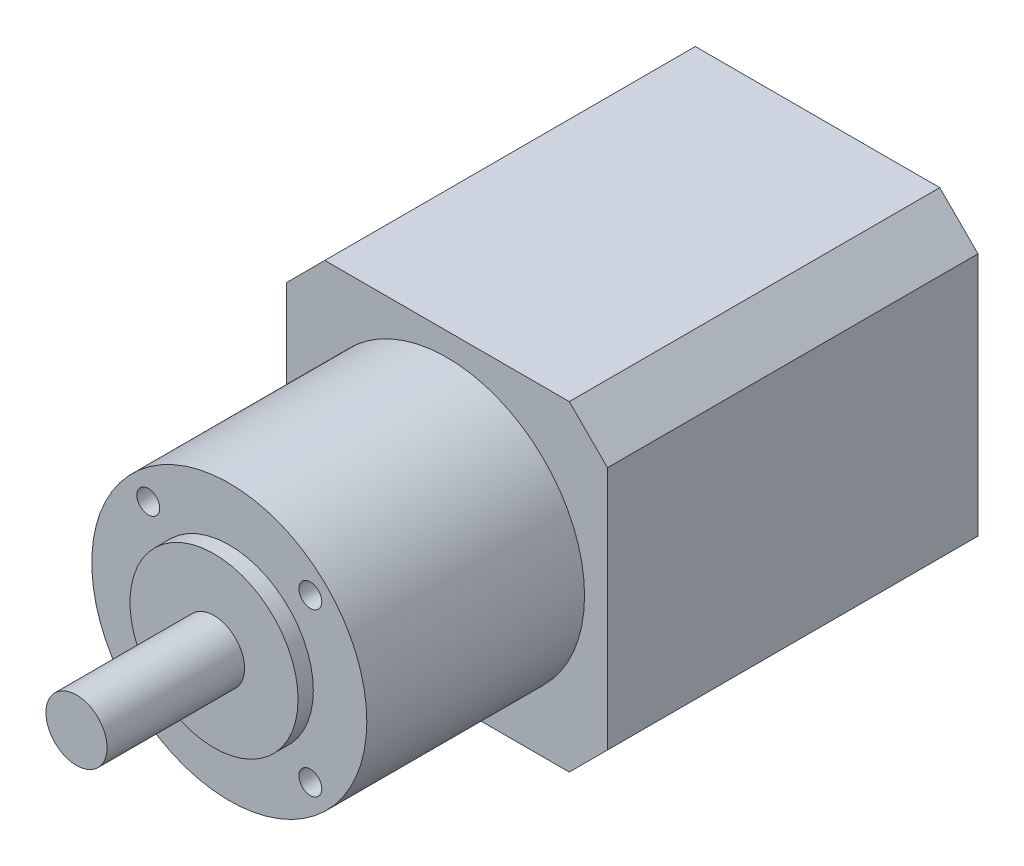
ISO-10303-21;
HEADER;
FILE_DESCRIPTION(('STEP AP214'),'2;1');
FILE_NAME('part.step','',(''),(''),'','','');
FILE_SCHEMA(('AUTOMOTIVE_DESIGN { 1 0 10303 214 1 1 1 1 }'));
ENDSEC;
DATA;
#1=APPLICATION_CONTEXT('core data for automotive mechanical design processes');
#2=APPLICATION_PROTOCOL_DEFINITION('international standard','automotive_design',2000,#1);
#3=PRODUCT_CONTEXT('',#1,'mechanical');
#4=PRODUCT('Part','Part','',(#3));
#5=PRODUCT_RELATED_PRODUCT_CATEGORY('part','',(#4));
#6=PRODUCT_DEFINITION_FORMATION('','',#4);
#7=PRODUCT_DEFINITION_CONTEXT('part definition',#1,'design');
#8=PRODUCT_DEFINITION('design','',#6,#7);
#9=PRODUCT_DEFINITION_SHAPE('','',#8);
#10=(LENGTH_UNIT() NAMED_UNIT(*) SI_UNIT(.MILLI.,.METRE.));
#11=(NAMED_UNIT(*) PLANE_ANGLE_UNIT() SI_UNIT($,.RADIAN.));
#12=(NAMED_UNIT(*) SI_UNIT($,.STERADIAN.) SOLID_ANGLE_UNIT());
#13=UNCERTAINTY_MEASURE_WITH_UNIT(LENGTH_MEASURE(1.E-05),#10,'distance_accuracy_value','');
#14=(GEOMETRIC_REPRESENTATION_CONTEXT(3) GLOBAL_UNCERTAINTY_ASSIGNED_CONTEXT((#13)) GLOBAL_UNIT_ASSIGNED_CONTEXT((#10,
#11,#12)) REPRESENTATION_CONTEXT('',''));
#15=CARTESIAN_POINT('',(0.,0.,0.));
#16=DIRECTION('',(0.,0.,1.));
#17=DIRECTION('',(1.,0.,0.));
#18=AXIS2_PLACEMENT_3D('',#15,#16,#17);
#19=CARTESIAN_POINT('',(21.,21.,48.5));
#20=DIRECTION('',(-1.,0.,0.));
#21=DIRECTION('',(0.,-1.,0.));
#22=AXIS2_PLACEMENT_3D('',#19,#20,#21);
#23=PLANE('',#22);
#24=DIRECTION('',(0.,1.,0.));
#25=VECTOR('',#24,1.);
#26=CARTESIAN_POINT('',(21.,21.,48.5));
#27=LINE('',#26,#25);
#28=CARTESIAN_POINT('',(21.,-16.,48.5));
#29=VERTEX_POINT('',#28);
#30=CARTESIAN_POINT('',(21.,16.,48.5));
#31=VERTEX_POINT('',#30);
#32=EDGE_CURVE('E126',#29,#31,#27,.T.);
#33=ORIENTED_EDGE('',*,*,#32,.F.);
#34=DIRECTION('',(0.,0.,-1.));
#35=VECTOR('',#34,1.);
#36=CARTESIAN_POINT('',(21.,-16.,48.5));
#37=LINE('',#36,#35);
#38=CARTESIAN_POINT('',(21.,-16.,0.));
#39=VERTEX_POINT('',#38);
#40=EDGE_CURVE('E110',#29,#39,#37,.T.);
#41=ORIENTED_EDGE('',*,*,#40,.T.);
#42=DIRECTION('',(0.,1.,0.));
#43=VECTOR('',#42,1.);
#44=CARTESIAN_POINT('',(21.,21.,0.));
#45=LINE('',#44,#43);
#46=CARTESIAN_POINT('',(21.,16.,0.));
#47=VERTEX_POINT('',#46);
#48=EDGE_CURVE('E123',#39,#47,#45,.T.);
#49=ORIENTED_EDGE('',*,*,#48,.T.);
#50=DIRECTION('',(0.,0.,1.));
#51=VECTOR('',#50,1.);
#52=CARTESIAN_POINT('',(21.,16.,48.5));
#53=LINE('',#52,#51);
#54=EDGE_CURVE('E129',#47,#31,#53,.T.);
#55=ORIENTED_EDGE('',*,*,#54,.T.);
#56=EDGE_LOOP('',(#33,#41,#49,#55));
#57=FACE_BOUND('',#56,.T.);
#58=ADVANCED_FACE('F39',(#57),#23,.F.);
#59=CARTESIAN_POINT('',(-21.,21.,48.5));
#60=DIRECTION('',(0.,-1.,0.));
#61=DIRECTION('',(0.,0.,-1.));
#62=AXIS2_PLACEMENT_3D('',#59,#60,#61);
#63=PLANE('',#62);
#64=DIRECTION('',(-1.,0.,0.));
#65=VECTOR('',#64,1.);
#66=CARTESIAN_POINT('',(-21.,21.,48.5));
#67=LINE('',#66,#65);
#68=CARTESIAN_POINT('',(16.,21.,48.5));
#69=VERTEX_POINT('',#68);
#70=CARTESIAN_POINT('',(-16.,21.,48.5));
#71=VERTEX_POINT('',#70);
#72=EDGE_CURVE('E195',#69,#71,#67,.T.);
#73=ORIENTED_EDGE('',*,*,#72,.F.);
#74=DIRECTION('',(0.,0.,-1.));
#75=VECTOR('',#74,1.);
#76=CARTESIAN_POINT('',(16.,21.,48.5));
#77=LINE('',#76,#75);
#78=CARTESIAN_POINT('',(16.,21.,0.));
#79=VERTEX_POINT('',#78);
#80=EDGE_CURVE('E183',#69,#79,#77,.T.);
#81=ORIENTED_EDGE('',*,*,#80,.T.);
#82=DIRECTION('',(-1.,0.,0.));
#83=VECTOR('',#82,1.);
#84=CARTESIAN_POINT('',(-21.,21.,0.));
#85=LINE('',#84,#83);
#86=CARTESIAN_POINT('',(-16.,21.,0.));
#87=VERTEX_POINT('',#86);
#88=EDGE_CURVE('E134',#79,#87,#85,.T.);
#89=ORIENTED_EDGE('',*,*,#88,.T.);
#90=DIRECTION('',(0.,0.,1.));
#91=VECTOR('',#90,1.);
#92=CARTESIAN_POINT('',(-16.,21.,48.5));
#93=LINE('',#92,#91);
#94=EDGE_CURVE('E180',#87,#71,#93,.T.);
#95=ORIENTED_EDGE('',*,*,#94,.T.);
#96=EDGE_LOOP('',(#73,#81,#89,#95));
#97=FACE_BOUND('',#96,.T.);
#98=ADVANCED_FACE('F286',(#97),#63,.F.);
#99=CARTESIAN_POINT('',(-21.,21.,48.5));
#100=DIRECTION('',(1.,0.,0.));
#101=DIRECTION('',(0.,1.,0.));
#102=AXIS2_PLACEMENT_3D('',#99,#100,#101);
#103=PLANE('',#102);
#104=DIRECTION('',(0.,-1.,0.));
#105=VECTOR('',#104,1.);
#106=CARTESIAN_POINT('',(-21.,21.,48.5));
#107=LINE('',#106,#105);
#108=CARTESIAN_POINT('',(-21.,16.,48.5));
#109=VERTEX_POINT('',#108);
#110=CARTESIAN_POINT('',(-21.,-16.,48.5));
#111=VERTEX_POINT('',#110);
#112=EDGE_CURVE('E193',#109,#111,#107,.T.);
#113=ORIENTED_EDGE('',*,*,#112,.F.);
#114=DIRECTION('',(0.,0.,-1.));
#115=VECTOR('',#114,1.);
#116=CARTESIAN_POINT('',(-21.,16.,48.5));
#117=LINE('',#116,#115);
#118=CARTESIAN_POINT('',(-21.,16.,0.));
#119=VERTEX_POINT('',#118);
#120=EDGE_CURVE('E11',#109,#119,#117,.T.);
#121=ORIENTED_EDGE('',*,*,#120,.T.);
#122=DIRECTION('',(0.,-1.,0.));
#123=VECTOR('',#122,1.);
#124=CARTESIAN_POINT('',(-21.,21.,0.));
#125=LINE('',#124,#123);
#126=CARTESIAN_POINT('',(-21.,-16.,0.));
#127=VERTEX_POINT('',#126);
#128=EDGE_CURVE('E140',#119,#127,#125,.T.);
#129=ORIENTED_EDGE('',*,*,#128,.T.);
#130=DIRECTION('',(0.,0.,1.));
#131=VECTOR('',#130,1.);
#132=CARTESIAN_POINT('',(-21.,-16.,48.5));
#133=LINE('',#132,#131);
#134=EDGE_CURVE('E48',#127,#111,#133,.T.);
#135=ORIENTED_EDGE('',*,*,#134,.T.);
#136=EDGE_LOOP('',(#113,#121,#129,#135));
#137=FACE_BOUND('',#136,.T.);
#138=ADVANCED_FACE('F279',(#137),#103,.F.);
#139=CARTESIAN_POINT('',(-21.,-21.,48.5));
#140=DIRECTION('',(0.,1.,0.));
#141=DIRECTION('',(0.,0.,1.));
#142=AXIS2_PLACEMENT_3D('',#139,#140,#141);
#143=PLANE('',#142);
#144=DIRECTION('',(1.,0.,0.));
#145=VECTOR('',#144,1.);
#146=CARTESIAN_POINT('',(-21.,-21.,0.));
#147=LINE('',#146,#145);
#148=CARTESIAN_POINT('',(-16.,-21.,0.));
#149=VERTEX_POINT('',#148);
#150=CARTESIAN_POINT('',(16.,-21.,0.));
#151=VERTEX_POINT('',#150);
#152=EDGE_CURVE('E151',#149,#151,#147,.T.);
#153=ORIENTED_EDGE('',*,*,#152,.T.);
#154=DIRECTION('',(0.,0.,1.));
#155=VECTOR('',#154,1.);
#156=CARTESIAN_POINT('',(16.,-21.,48.5));
#157=LINE('',#156,#155);
#158=CARTESIAN_POINT('',(16.,-21.,48.5));
#159=VERTEX_POINT('',#158);
#160=EDGE_CURVE('E111',#151,#159,#157,.T.);
#161=ORIENTED_EDGE('',*,*,#160,.T.);
#162=DIRECTION('',(1.,0.,0.));
#163=VECTOR('',#162,1.);
#164=CARTESIAN_POINT('',(-21.,-21.,48.5));
#165=LINE('',#164,#163);
#166=CARTESIAN_POINT('',(-16.,-21.,48.5));
#167=VERTEX_POINT('',#166);
#168=EDGE_CURVE('E146',#167,#159,#165,.T.);
#169=ORIENTED_EDGE('',*,*,#168,.F.);
#170=DIRECTION('',(0.,0.,-1.));
#171=VECTOR('',#170,1.);
#172=CARTESIAN_POINT('',(-16.,-21.,48.5));
#173=LINE('',#172,#171);
#174=EDGE_CURVE('E117',#167,#149,#173,.T.);
#175=ORIENTED_EDGE('',*,*,#174,.T.);
#176=EDGE_LOOP('',(#153,#161,#169,#175));
#177=FACE_BOUND('',#176,.T.);
#178=ADVANCED_FACE('F271',(#177),#143,.F.);
#179=CARTESIAN_POINT('',(0.,0.,48.5));
#180=DIRECTION('',(0.,0.,1.));
#181=DIRECTION('',(1.,0.,0.));
#182=AXIS2_PLACEMENT_3D('',#179,#180,#181);
#183=PLANE('',#182);
#184=CARTESIAN_POINT('',(0.,0.,48.5));
#185=DIRECTION('',(0.,0.,1.));
#186=DIRECTION('',(1.,0.,0.));
#187=AXIS2_PLACEMENT_3D('',#184,#185,#186);
#188=CIRCLE('',#187,18.);
#189=CARTESIAN_POINT('',(18.,0.,48.5));
#190=VERTEX_POINT('',#189);
#191=EDGE_CURVE('E155',#190,#190,#188,.T.);
#192=ORIENTED_EDGE('',*,*,#191,.F.);
#193=EDGE_LOOP('',(#192));
#194=FACE_BOUND('',#193,.T.);
#195=ORIENTED_EDGE('',*,*,#168,.T.);
#196=DIRECTION('',(-0.70710678118655,-0.707106781186546,0.));
#197=VECTOR('',#196,1.);
#198=CARTESIAN_POINT('',(18.4999999999999,-18.5,48.5));
#199=LINE('',#198,#197);
#200=EDGE_CURVE('E177',#159,#29,#199,.F.);
#201=ORIENTED_EDGE('',*,*,#200,.T.);
#202=ORIENTED_EDGE('',*,*,#32,.T.);
#203=DIRECTION('',(0.707106781186546,-0.707106781186549,0.));
#204=VECTOR('',#203,1.);
#205=CARTESIAN_POINT('',(18.5,18.5,48.5));
#206=LINE('',#205,#204);
#207=EDGE_CURVE('E174',#31,#69,#206,.F.);
#208=ORIENTED_EDGE('',*,*,#207,.T.);
#209=ORIENTED_EDGE('',*,*,#72,.T.);
#210=DIRECTION('',(0.707106781186548,0.707106781186547,0.));
#211=VECTOR('',#210,1.);
#212=CARTESIAN_POINT('',(-18.5,18.5,48.5));
#213=LINE('',#212,#211);
#214=EDGE_CURVE('E61',#71,#109,#213,.F.);
#215=ORIENTED_EDGE('',*,*,#214,.T.);
#216=ORIENTED_EDGE('',*,*,#112,.T.);
#217=DIRECTION('',(-0.707106781186546,0.707106781186549,0.));
#218=VECTOR('',#217,1.);
#219=CARTESIAN_POINT('',(-18.5,-18.5,48.5));
#220=LINE('',#219,#218);
#221=EDGE_CURVE('E169',#111,#167,#220,.F.);
#222=ORIENTED_EDGE('',*,*,#221,.T.);
#223=EDGE_LOOP('',(#195,#201,#202,#208,#209,#215,#216,#222));
#224=FACE_BOUND('',#223,.T.);
#225=ADVANCED_FACE('F269',(#194,#224),#183,.T.);
#226=CARTESIAN_POINT('',(0.,0.,0.));
#227=DIRECTION('',(0.,0.,1.));
#228=DIRECTION('',(1.,0.,0.));
#229=AXIS2_PLACEMENT_3D('',#226,#227,#228);
#230=PLANE('',#229);
#231=ORIENTED_EDGE('',*,*,#48,.F.);
#232=DIRECTION('',(0.70710678118655,0.707106781186546,0.));
#233=VECTOR('',#232,1.);
#234=CARTESIAN_POINT('',(21.,-16.,0.));
#235=LINE('',#234,#233);
#236=EDGE_CURVE('E106',#39,#151,#235,.F.);
#237=ORIENTED_EDGE('',*,*,#236,.T.);
#238=ORIENTED_EDGE('',*,*,#152,.F.);
#239=DIRECTION('',(0.707106781186546,-0.707106781186549,0.));
#240=VECTOR('',#239,1.);
#241=CARTESIAN_POINT('',(-16.,-21.,0.));
#242=LINE('',#241,#240);
#243=EDGE_CURVE('E128',#149,#127,#242,.F.);
#244=ORIENTED_EDGE('',*,*,#243,.T.);
#245=ORIENTED_EDGE('',*,*,#128,.F.);
#246=DIRECTION('',(-0.707106781186548,-0.707106781186547,0.));
#247=VECTOR('',#246,1.);
#248=CARTESIAN_POINT('',(-21.,16.,0.));
#249=LINE('',#248,#247);
#250=EDGE_CURVE('E159',#119,#87,#249,.F.);
#251=ORIENTED_EDGE('',*,*,#250,.T.);
#252=ORIENTED_EDGE('',*,*,#88,.F.);
#253=DIRECTION('',(-0.707106781186546,0.707106781186549,0.));
#254=VECTOR('',#253,1.);
#255=CARTESIAN_POINT('',(16.,21.,0.));
#256=LINE('',#255,#254);
#257=EDGE_CURVE('E118',#79,#47,#256,.F.);
#258=ORIENTED_EDGE('',*,*,#257,.T.);
#259=EDGE_LOOP('',(#231,#237,#238,#244,#245,#251,#252,#258));
#260=FACE_BOUND('',#259,.T.);
#261=ADVANCED_FACE('F131',(#260),#230,.F.);
#262=CARTESIAN_POINT('',(0.,0.,77.));
#263=DIRECTION('',(0.,0.,-1.));
#264=DIRECTION('',(-1.,0.,0.));
#265=AXIS2_PLACEMENT_3D('',#262,#263,#264);
#266=CYLINDRICAL_SURFACE('',#265,18.);
#267=CARTESIAN_POINT('',(0.,0.,77.));
#268=DIRECTION('',(0.,0.,1.));
#269=DIRECTION('',(1.,0.,0.));
#270=AXIS2_PLACEMENT_3D('',#267,#268,#269);
#271=CIRCLE('',#270,18.);
#272=CARTESIAN_POINT('',(18.,0.,77.));
#273=VERTEX_POINT('',#272);
#274=EDGE_CURVE('E135',#273,#273,#271,.T.);
#275=ORIENTED_EDGE('',*,*,#274,.F.);
#276=EDGE_LOOP('',(#275));
#277=FACE_BOUND('',#276,.T.);
#278=ORIENTED_EDGE('',*,*,#191,.T.);
#279=EDGE_LOOP('',(#278));
#280=FACE_BOUND('',#279,.T.);
#281=ADVANCED_FACE('F255',(#277,#280),#266,.T.);
#282=CARTESIAN_POINT('',(0.,0.,77.));
#283=DIRECTION('',(0.,0.,1.));
#284=DIRECTION('',(1.,0.,0.));
#285=AXIS2_PLACEMENT_3D('',#282,#283,#284);
#286=PLANE('',#285);
#287=CARTESIAN_POINT('',(10.6066017177982,-10.6066017177982,77.));
#288=DIRECTION('',(0.,0.,1.));
#289=DIRECTION('',(1.,0.,0.));
#290=AXIS2_PLACEMENT_3D('',#287,#288,#289);
#291=CIRCLE('',#290,1.5);
#292=CARTESIAN_POINT('',(12.1066017177982,-10.6066017177982,77.));
#293=VERTEX_POINT('',#292);
#294=EDGE_CURVE('E229',#293,#293,#291,.T.);
#295=ORIENTED_EDGE('',*,*,#294,.F.);
#296=EDGE_LOOP('',(#295));
#297=FACE_BOUND('',#296,.T.);
#298=CARTESIAN_POINT('',(10.6066017177983,10.6066017177981,77.));
#299=DIRECTION('',(0.,0.,1.));
#300=DIRECTION('',(1.,0.,0.));
#301=AXIS2_PLACEMENT_3D('',#298,#299,#300);
#302=CIRCLE('',#301,1.5);
#303=CARTESIAN_POINT('',(12.1066017177983,10.6066017177981,77.));
#304=VERTEX_POINT('',#303);
#305=EDGE_CURVE('E237',#304,#304,#302,.T.);
#306=ORIENTED_EDGE('',*,*,#305,.F.);
#307=EDGE_LOOP('',(#306));
#308=FACE_BOUND('',#307,.T.);
#309=CARTESIAN_POINT('',(-10.6066017177981,10.6066017177983,77.));
#310=DIRECTION('',(0.,0.,1.));
#311=DIRECTION('',(1.,0.,0.));
#312=AXIS2_PLACEMENT_3D('',#309,#310,#311);
#313=CIRCLE('',#312,1.5);
#314=CARTESIAN_POINT('',(-9.10660171779814,10.6066017177983,77.));
#315=VERTEX_POINT('',#314);
#316=EDGE_CURVE('E221',#315,#315,#313,.T.);
#317=ORIENTED_EDGE('',*,*,#316,.F.);
#318=EDGE_LOOP('',(#317));
#319=FACE_BOUND('',#318,.T.);
#320=CARTESIAN_POINT('',(-10.6066017177982,-10.6066017177982,77.));
#321=DIRECTION('',(0.,0.,1.));
#322=DIRECTION('',(1.,0.,0.));
#323=AXIS2_PLACEMENT_3D('',#320,#321,#322);
#324=CIRCLE('',#323,1.5);
#325=CARTESIAN_POINT('',(-9.10660171779825,-10.6066017177982,77.));
#326=VERTEX_POINT('',#325);
#327=EDGE_CURVE('E217',#326,#326,#324,.T.);
#328=ORIENTED_EDGE('',*,*,#327,.F.);
#329=EDGE_LOOP('',(#328));
#330=FACE_BOUND('',#329,.T.);
#331=CARTESIAN_POINT('',(0.,0.,77.));
#332=DIRECTION('',(0.,0.,1.));
#333=DIRECTION('',(1.,0.,0.));
#334=AXIS2_PLACEMENT_3D('',#331,#332,#333);
#335=CIRCLE('',#334,11.);
#336=CARTESIAN_POINT('',(11.,0.,77.));
#337=VERTEX_POINT('',#336);
#338=EDGE_CURVE('E201',#337,#337,#335,.T.);
#339=ORIENTED_EDGE('',*,*,#338,.F.);
#340=EDGE_LOOP('',(#339));
#341=FACE_BOUND('',#340,.T.);
#342=ORIENTED_EDGE('',*,*,#274,.T.);
#343=EDGE_LOOP('',(#342));
#344=FACE_BOUND('',#343,.T.);
#345=ADVANCED_FACE('F251',(#297,#308,#319,#330,#341,#344),#286,.T.);
#346=CARTESIAN_POINT('',(0.,0.,79.));
#347=DIRECTION('',(0.,0.,1.));
#348=DIRECTION('',(1.,0.,0.));
#349=AXIS2_PLACEMENT_3D('',#346,#347,#348);
#350=PLANE('',#349);
#351=CARTESIAN_POINT('',(0.,0.,79.));
#352=DIRECTION('',(0.,0.,1.));
#353=DIRECTION('',(1.,0.,0.));
#354=AXIS2_PLACEMENT_3D('',#351,#352,#353);
#355=CIRCLE('',#354,11.);
#356=CARTESIAN_POINT('',(11.,0.,79.));
#357=VERTEX_POINT('',#356);
#358=EDGE_CURVE('E143',#357,#357,#355,.T.);
#359=ORIENTED_EDGE('',*,*,#358,.T.);
#360=EDGE_LOOP('',(#359));
#361=FACE_BOUND('',#360,.T.);
#362=CARTESIAN_POINT('',(0.,0.,79.));
#363=DIRECTION('',(0.,0.,1.));
#364=DIRECTION('',(1.,0.,0.));
#365=AXIS2_PLACEMENT_3D('',#362,#363,#364);
#366=CIRCLE('',#365,4.);
#367=CARTESIAN_POINT('',(4.,0.,79.));
#368=VERTEX_POINT('',#367);
#369=EDGE_CURVE('E205',#368,#368,#366,.T.);
#370=ORIENTED_EDGE('',*,*,#369,.F.);
#371=EDGE_LOOP('',(#370));
#372=FACE_BOUND('',#371,.T.);
#373=ADVANCED_FACE('F254',(#361,#372),#350,.T.);
#374=CARTESIAN_POINT('',(0.,0.,79.));
#375=DIRECTION('',(0.,0.,-1.));
#376=DIRECTION('',(-1.,0.,0.));
#377=AXIS2_PLACEMENT_3D('',#374,#375,#376);
#378=CYLINDRICAL_SURFACE('',#377,11.);
#379=ORIENTED_EDGE('',*,*,#358,.F.);
#380=EDGE_LOOP('',(#379));
#381=FACE_BOUND('',#380,.T.);
#382=ORIENTED_EDGE('',*,*,#338,.T.);
#383=EDGE_LOOP('',(#382));
#384=FACE_BOUND('',#383,.T.);
#385=ADVANCED_FACE('F311',(#381,#384),#378,.T.);
#386=CARTESIAN_POINT('',(0.,0.,97.));
#387=DIRECTION('',(0.,0.,-1.));
#388=DIRECTION('',(-1.,0.,0.));
#389=AXIS2_PLACEMENT_3D('',#386,#387,#388);
#390=CYLINDRICAL_SURFACE('',#389,4.);
#391=ORIENTED_EDGE('',*,*,#369,.T.);
#392=EDGE_LOOP('',(#391));
#393=FACE_BOUND('',#392,.T.);
#394=CARTESIAN_POINT('',(0.,0.,97.));
#395=DIRECTION('',(0.,0.,1.));
#396=DIRECTION('',(1.,0.,0.));
#397=AXIS2_PLACEMENT_3D('',#394,#395,#396);
#398=CIRCLE('',#397,4.);
#399=CARTESIAN_POINT('',(4.,0.,97.));
#400=VERTEX_POINT('',#399);
#401=EDGE_CURVE('E212',#400,#400,#398,.T.);
#402=ORIENTED_EDGE('',*,*,#401,.F.);
#403=EDGE_LOOP('',(#402));
#404=FACE_BOUND('',#403,.T.);
#405=ADVANCED_FACE('F314',(#393,#404),#390,.T.);
#406=CARTESIAN_POINT('',(0.,0.,97.));
#407=DIRECTION('',(0.,0.,1.));
#408=DIRECTION('',(1.,0.,0.));
#409=AXIS2_PLACEMENT_3D('',#406,#407,#408);
#410=PLANE('',#409);
#411=ORIENTED_EDGE('',*,*,#401,.T.);
#412=EDGE_LOOP('',(#411));
#413=FACE_BOUND('',#412,.T.);
#414=ADVANCED_FACE('F321',(#413),#410,.T.);
#415=CARTESIAN_POINT('',(-10.6066017177982,-10.6066017177982,67.));
#416=DIRECTION('',(0.,0.,1.));
#417=DIRECTION('',(1.,0.,0.));
#418=AXIS2_PLACEMENT_3D('',#415,#416,#417);
#419=CYLINDRICAL_SURFACE('',#418,1.5);
#420=CARTESIAN_POINT('',(-10.6066017177982,-10.6066017177982,67.));
#421=DIRECTION('',(0.,0.,1.));
#422=DIRECTION('',(1.,0.,0.));
#423=AXIS2_PLACEMENT_3D('',#420,#421,#422);
#424=CIRCLE('',#423,1.5);
#425=CARTESIAN_POINT('',(-9.10660171779825,-10.6066017177982,67.));
#426=VERTEX_POINT('',#425);
#427=EDGE_CURVE('E216',#426,#426,#424,.T.);
#428=ORIENTED_EDGE('',*,*,#427,.F.);
#429=EDGE_LOOP('',(#428));
#430=FACE_BOUND('',#429,.T.);
#431=ORIENTED_EDGE('',*,*,#327,.T.);
#432=EDGE_LOOP('',(#431));
#433=FACE_BOUND('',#432,.T.);
#434=ADVANCED_FACE('F325',(#430,#433),#419,.F.);
#435=CARTESIAN_POINT('',(-10.6066017177982,-10.6066017177982,67.));
#436=DIRECTION('',(0.,0.,1.));
#437=DIRECTION('',(1.,0.,0.));
#438=AXIS2_PLACEMENT_3D('',#435,#436,#437);
#439=PLANE('',#438);
#440=ORIENTED_EDGE('',*,*,#427,.T.);
#441=EDGE_LOOP('',(#440));
#442=FACE_BOUND('',#441,.T.);
#443=ADVANCED_FACE('F329',(#442),#439,.T.);
#444=CARTESIAN_POINT('',(-10.6066017177981,10.6066017177983,67.));
#445=DIRECTION('',(0.,0.,1.));
#446=DIRECTION('',(1.,0.,0.));
#447=AXIS2_PLACEMENT_3D('',#444,#445,#446);
#448=CYLINDRICAL_SURFACE('',#447,1.5);
#449=CARTESIAN_POINT('',(-10.6066017177981,10.6066017177983,67.));
#450=DIRECTION('',(0.,0.,1.));
#451=DIRECTION('',(1.,0.,0.));
#452=AXIS2_PLACEMENT_3D('',#449,#450,#451);
#453=CIRCLE('',#452,1.5);
#454=CARTESIAN_POINT('',(-9.10660171779814,10.6066017177983,67.));
#455=VERTEX_POINT('',#454);
#456=EDGE_CURVE('E241',#455,#455,#453,.T.);
#457=ORIENTED_EDGE('',*,*,#456,.F.);
#458=EDGE_LOOP('',(#457));
#459=FACE_BOUND('',#458,.T.);
#460=ORIENTED_EDGE('',*,*,#316,.T.);
#461=EDGE_LOOP('',(#460));
#462=FACE_BOUND('',#461,.T.);
#463=ADVANCED_FACE('F249',(#459,#462),#448,.F.);
#464=CARTESIAN_POINT('',(-10.6066017177981,10.6066017177983,67.));
#465=DIRECTION('',(0.,0.,1.));
#466=DIRECTION('',(1.,0.,0.));
#467=AXIS2_PLACEMENT_3D('',#464,#465,#466);
#468=PLANE('',#467);
#469=ORIENTED_EDGE('',*,*,#456,.T.);
#470=EDGE_LOOP('',(#469));
#471=FACE_BOUND('',#470,.T.);
#472=ADVANCED_FACE('F348',(#471),#468,.T.);
#473=CARTESIAN_POINT('',(10.6066017177983,10.6066017177981,67.));
#474=DIRECTION('',(0.,0.,1.));
#475=DIRECTION('',(1.,0.,0.));
#476=AXIS2_PLACEMENT_3D('',#473,#474,#475);
#477=CYLINDRICAL_SURFACE('',#476,1.5);
#478=CARTESIAN_POINT('',(10.6066017177983,10.6066017177981,67.));
#479=DIRECTION('',(0.,0.,1.));
#480=DIRECTION('',(1.,0.,0.));
#481=AXIS2_PLACEMENT_3D('',#478,#479,#480);
#482=CIRCLE('',#481,1.5);
#483=CARTESIAN_POINT('',(12.1066017177983,10.6066017177981,67.));
#484=VERTEX_POINT('',#483);
#485=EDGE_CURVE('E233',#484,#484,#482,.T.);
#486=ORIENTED_EDGE('',*,*,#485,.F.);
#487=EDGE_LOOP('',(#486));
#488=FACE_BOUND('',#487,.T.);
#489=ORIENTED_EDGE('',*,*,#305,.T.);
#490=EDGE_LOOP('',(#489));
#491=FACE_BOUND('',#490,.T.);
#492=ADVANCED_FACE('F344',(#488,#491),#477,.F.);
#493=CARTESIAN_POINT('',(10.6066017177983,10.6066017177981,67.));
#494=DIRECTION('',(0.,0.,1.));
#495=DIRECTION('',(1.,0.,0.));
#496=AXIS2_PLACEMENT_3D('',#493,#494,#495);
#497=PLANE('',#496);
#498=ORIENTED_EDGE('',*,*,#485,.T.);
#499=EDGE_LOOP('',(#498));
#500=FACE_BOUND('',#499,.T.);
#501=ADVANCED_FACE('F340',(#500),#497,.T.);
#502=CARTESIAN_POINT('',(10.6066017177982,-10.6066017177982,67.));
#503=DIRECTION('',(0.,0.,1.));
#504=DIRECTION('',(1.,0.,0.));
#505=AXIS2_PLACEMENT_3D('',#502,#503,#504);
#506=CYLINDRICAL_SURFACE('',#505,1.5);
#507=CARTESIAN_POINT('',(10.6066017177982,-10.6066017177982,67.));
#508=DIRECTION('',(0.,0.,1.));
#509=DIRECTION('',(1.,0.,0.));
#510=AXIS2_PLACEMENT_3D('',#507,#508,#509);
#511=CIRCLE('',#510,1.5);
#512=CARTESIAN_POINT('',(12.1066017177982,-10.6066017177982,67.));
#513=VERTEX_POINT('',#512);
#514=EDGE_CURVE('E225',#513,#513,#511,.T.);
#515=ORIENTED_EDGE('',*,*,#514,.F.);
#516=EDGE_LOOP('',(#515));
#517=FACE_BOUND('',#516,.T.);
#518=ORIENTED_EDGE('',*,*,#294,.T.);
#519=EDGE_LOOP('',(#518));
#520=FACE_BOUND('',#519,.T.);
#521=ADVANCED_FACE('F336',(#517,#520),#506,.F.);
#522=CARTESIAN_POINT('',(10.6066017177982,-10.6066017177982,67.));
#523=DIRECTION('',(0.,0.,1.));
#524=DIRECTION('',(1.,0.,0.));
#525=AXIS2_PLACEMENT_3D('',#522,#523,#524);
#526=PLANE('',#525);
#527=ORIENTED_EDGE('',*,*,#514,.T.);
#528=EDGE_LOOP('',(#527));
#529=FACE_BOUND('',#528,.T.);
#530=ADVANCED_FACE('F296',(#529),#526,.T.);
#531=CARTESIAN_POINT('',(21.,-16.,48.5));
#532=DIRECTION('',(-0.707106781186545,0.707106781186549,0.));
#533=DIRECTION('',(0.,0.,-1.));
#534=AXIS2_PLACEMENT_3D('',#531,#532,#533);
#535=PLANE('',#534);
#536=ORIENTED_EDGE('',*,*,#200,.F.);
#537=ORIENTED_EDGE('',*,*,#160,.F.);
#538=ORIENTED_EDGE('',*,*,#236,.F.);
#539=ORIENTED_EDGE('',*,*,#40,.F.);
#540=EDGE_LOOP('',(#536,#537,#538,#539));
#541=FACE_BOUND('',#540,.T.);
#542=ADVANCED_FACE('F109',(#541),#535,.F.);
#543=CARTESIAN_POINT('',(16.,21.,48.5));
#544=DIRECTION('',(-0.707106781186549,-0.707106781186546,0.));
#545=DIRECTION('',(0.,0.,-1.));
#546=AXIS2_PLACEMENT_3D('',#543,#544,#545);
#547=PLANE('',#546);
#548=ORIENTED_EDGE('',*,*,#207,.F.);
#549=ORIENTED_EDGE('',*,*,#54,.F.);
#550=ORIENTED_EDGE('',*,*,#257,.F.);
#551=ORIENTED_EDGE('',*,*,#80,.F.);
#552=EDGE_LOOP('',(#548,#549,#550,#551));
#553=FACE_BOUND('',#552,.T.);
#554=ADVANCED_FACE('F289',(#553),#547,.F.);
#555=CARTESIAN_POINT('',(-21.,16.,48.5));
#556=DIRECTION('',(0.707106781186547,-0.707106781186548,0.));
#557=DIRECTION('',(0.,0.,-1.));
#558=AXIS2_PLACEMENT_3D('',#555,#556,#557);
#559=PLANE('',#558);
#560=ORIENTED_EDGE('',*,*,#214,.F.);
#561=ORIENTED_EDGE('',*,*,#94,.F.);
#562=ORIENTED_EDGE('',*,*,#250,.F.);
#563=ORIENTED_EDGE('',*,*,#120,.F.);
#564=EDGE_LOOP('',(#560,#561,#562,#563));
#565=FACE_BOUND('',#564,.T.);
#566=ADVANCED_FACE('F282',(#565),#559,.F.);
#567=CARTESIAN_POINT('',(-16.,-21.,48.5));
#568=DIRECTION('',(0.707106781186549,0.707106781186546,0.));
#569=DIRECTION('',(0.,0.,-1.));
#570=AXIS2_PLACEMENT_3D('',#567,#568,#569);
#571=PLANE('',#570);
#572=ORIENTED_EDGE('',*,*,#221,.F.);
#573=ORIENTED_EDGE('',*,*,#134,.F.);
#574=ORIENTED_EDGE('',*,*,#243,.F.);
#575=ORIENTED_EDGE('',*,*,#174,.F.);
#576=EDGE_LOOP('',(#572,#573,#574,#575));
#577=FACE_BOUND('',#576,.T.);
#578=ADVANCED_FACE('F41',(#577),#571,.F.);
#579=CLOSED_SHELL('',(#58,#98,#138,#178,#225,#261,#281,#345,#373,#385,#405,#414,#434,#443,#463,
#472,#492,#501,#521,#530,#542,#554,#566,#578));
#580=MANIFOLD_SOLID_BREP('B2',#579);
#581=ADVANCED_BREP_SHAPE_REPRESENTATION('',(#18,#580),#14);
#582=SHAPE_DEFINITION_REPRESENTATION(#9,#581);
ENDSEC;
END-ISO-10303-21;
